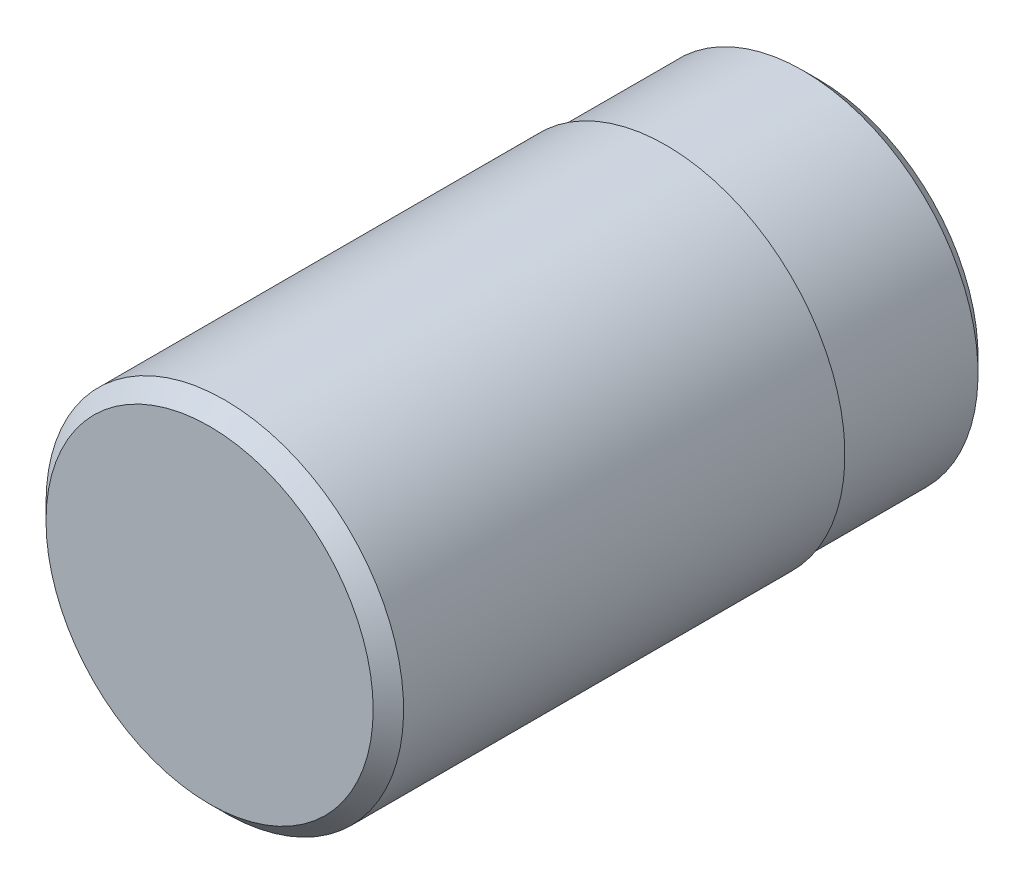
ISO-10303-21;
HEADER;
FILE_DESCRIPTION(('STEP AP214'),'2;1');
FILE_NAME('part.step','',(''),(''),'','','');
FILE_SCHEMA(('AUTOMOTIVE_DESIGN { 1 0 10303 214 1 1 1 1 }'));
ENDSEC;
DATA;
#1=APPLICATION_CONTEXT('core data for automotive mechanical design processes');
#2=APPLICATION_PROTOCOL_DEFINITION('international standard','automotive_design',2000,#1);
#3=PRODUCT_CONTEXT('',#1,'mechanical');
#4=PRODUCT('Part','Part','',(#3));
#5=PRODUCT_RELATED_PRODUCT_CATEGORY('part','',(#4));
#6=PRODUCT_DEFINITION_FORMATION('','',#4);
#7=PRODUCT_DEFINITION_CONTEXT('part definition',#1,'design');
#8=PRODUCT_DEFINITION('design','',#6,#7);
#9=PRODUCT_DEFINITION_SHAPE('','',#8);
#10=(LENGTH_UNIT() NAMED_UNIT(*) SI_UNIT(.MILLI.,.METRE.));
#11=(NAMED_UNIT(*) PLANE_ANGLE_UNIT() SI_UNIT($,.RADIAN.));
#12=(NAMED_UNIT(*) SI_UNIT($,.STERADIAN.) SOLID_ANGLE_UNIT());
#13=UNCERTAINTY_MEASURE_WITH_UNIT(LENGTH_MEASURE(1.E-05),#10,'distance_accuracy_value','');
#14=(GEOMETRIC_REPRESENTATION_CONTEXT(3) GLOBAL_UNCERTAINTY_ASSIGNED_CONTEXT((#13)) GLOBAL_UNIT_ASSIGNED_CONTEXT((#10,
#11,#12)) REPRESENTATION_CONTEXT('',''));
#15=CARTESIAN_POINT('',(0.,0.,0.));
#16=DIRECTION('',(0.,0.,1.));
#17=DIRECTION('',(1.,0.,0.));
#18=AXIS2_PLACEMENT_3D('',#15,#16,#17);
#19=CARTESIAN_POINT('',(0.,0.,3.5));
#20=DIRECTION('',(0.,0.,1.));
#21=DIRECTION('',(1.,0.,0.));
#22=AXIS2_PLACEMENT_3D('',#19,#20,#21);
#23=PLANE('',#22);
#24=CARTESIAN_POINT('',(0.,-27.8,3.5));
#25=DIRECTION('',(0.,0.,1.));
#26=DIRECTION('',(-1.,0.,0.));
#27=AXIS2_PLACEMENT_3D('',#24,#25,#26);
#28=CIRCLE('',#27,2.15);
#29=CARTESIAN_POINT('',(0.,-25.65,3.5));
#30=VERTEX_POINT('',#29);
#31=EDGE_CURVE('E125',#30,#30,#28,.T.);
#32=ORIENTED_EDGE('',*,*,#31,.T.);
#33=EDGE_LOOP('',(#32));
#34=FACE_BOUND('',#33,.T.);
#35=ADVANCED_FACE('F16',(#34),#23,.T.);
#36=CARTESIAN_POINT('',(0.,-27.8,-2.5));
#37=DIRECTION('',(0.,0.,1.));
#38=DIRECTION('',(1.,0.,0.));
#39=AXIS2_PLACEMENT_3D('',#36,#37,#38);
#40=CYLINDRICAL_SURFACE('',#39,2.35);
#41=CARTESIAN_POINT('',(0.,-27.8,3.3));
#42=DIRECTION('',(0.,0.,1.));
#43=DIRECTION('',(-1.,0.,0.));
#44=AXIS2_PLACEMENT_3D('',#41,#42,#43);
#45=CIRCLE('',#44,2.35);
#46=CARTESIAN_POINT('',(-2.35,-27.8,3.3));
#47=VERTEX_POINT('',#46);
#48=CARTESIAN_POINT('',(0.,-25.45,3.3));
#49=VERTEX_POINT('',#48);
#50=EDGE_CURVE('E126',#47,#49,#45,.T.);
#51=ORIENTED_EDGE('',*,*,#50,.F.);
#52=DIRECTION('',(0.,0.,-1.));
#53=VECTOR('',#52,1.);
#54=CARTESIAN_POINT('',(-2.35,-27.8,-2.5));
#55=LINE('',#54,#53);
#56=CARTESIAN_POINT('',(-2.35,-27.8,-2.5));
#57=VERTEX_POINT('',#56);
#58=EDGE_CURVE('E11',#47,#57,#55,.T.);
#59=ORIENTED_EDGE('',*,*,#58,.T.);
#60=CARTESIAN_POINT('',(0.,-27.8,-2.5));
#61=DIRECTION('',(0.,0.,-1.));
#62=DIRECTION('',(1.,0.,0.));
#63=AXIS2_PLACEMENT_3D('',#60,#61,#62);
#64=CIRCLE('',#63,2.35);
#65=EDGE_CURVE('E26',#57,#57,#64,.T.);
#66=ORIENTED_EDGE('',*,*,#65,.F.);
#67=ORIENTED_EDGE('',*,*,#58,.F.);
#68=CARTESIAN_POINT('',(0.,-27.8,3.3));
#69=DIRECTION('',(0.,0.,1.));
#70=DIRECTION('',(-1.,0.,0.));
#71=AXIS2_PLACEMENT_3D('',#68,#69,#70);
#72=CIRCLE('',#71,2.35);
#73=EDGE_CURVE('E120',#49,#47,#72,.T.);
#74=ORIENTED_EDGE('',*,*,#73,.F.);
#75=EDGE_LOOP('',(#51,#59,#66,#67,#74));
#76=FACE_BOUND('',#75,.T.);
#77=ADVANCED_FACE('F191',(#76),#40,.T.);
#78=CARTESIAN_POINT('',(0.,0.,-2.5));
#79=DIRECTION('',(0.,0.,1.));
#80=DIRECTION('',(1.,0.,0.));
#81=AXIS2_PLACEMENT_3D('',#78,#79,#80);
#82=PLANE('',#81);
#83=CARTESIAN_POINT('',(0.,-27.8,-2.5));
#84=DIRECTION('',(0.,0.,1.));
#85=DIRECTION('',(1.,0.,0.));
#86=AXIS2_PLACEMENT_3D('',#83,#84,#85);
#87=CIRCLE('',#86,2.3);
#88=CARTESIAN_POINT('',(-2.3,-27.8,-2.5));
#89=VERTEX_POINT('',#88);
#90=EDGE_CURVE('E151',#89,#89,#87,.T.);
#91=ORIENTED_EDGE('',*,*,#90,.T.);
#92=EDGE_LOOP('',(#91));
#93=FACE_BOUND('',#92,.T.);
#94=ORIENTED_EDGE('',*,*,#65,.T.);
#95=EDGE_LOOP('',(#94));
#96=FACE_BOUND('',#95,.T.);
#97=ADVANCED_FACE('F193',(#93,#96),#82,.F.);
#98=CARTESIAN_POINT('',(0.,-27.8,-2.5));
#99=DIRECTION('',(0.,0.,1.));
#100=DIRECTION('',(1.,0.,0.));
#101=AXIS2_PLACEMENT_3D('',#98,#99,#100);
#102=CYLINDRICAL_SURFACE('',#101,2.3);
#103=ORIENTED_EDGE('',*,*,#90,.F.);
#104=DIRECTION('',(0.,0.,-1.));
#105=VECTOR('',#104,1.);
#106=CARTESIAN_POINT('',(-2.3,-27.8,-2.5));
#107=LINE('',#106,#105);
#108=CARTESIAN_POINT('',(-2.3,-27.8,-4.3));
#109=VERTEX_POINT('',#108);
#110=EDGE_CURVE('E19',#89,#109,#107,.T.);
#111=ORIENTED_EDGE('',*,*,#110,.T.);
#112=CARTESIAN_POINT('',(0.,-27.8,-4.3));
#113=DIRECTION('',(0.,0.,-1.));
#114=DIRECTION('',(1.,0.,0.));
#115=AXIS2_PLACEMENT_3D('',#112,#113,#114);
#116=CIRCLE('',#115,2.3);
#117=CARTESIAN_POINT('',(0.,-25.5,-4.3));
#118=VERTEX_POINT('',#117);
#119=EDGE_CURVE('E115',#118,#109,#116,.T.);
#120=ORIENTED_EDGE('',*,*,#119,.F.);
#121=CARTESIAN_POINT('',(0.,-27.8,-4.3));
#122=DIRECTION('',(0.,0.,-1.));
#123=DIRECTION('',(1.,0.,0.));
#124=AXIS2_PLACEMENT_3D('',#121,#122,#123);
#125=CIRCLE('',#124,2.3);
#126=EDGE_CURVE('E119',#109,#118,#125,.T.);
#127=ORIENTED_EDGE('',*,*,#126,.F.);
#128=ORIENTED_EDGE('',*,*,#110,.F.);
#129=EDGE_LOOP('',(#103,#111,#120,#127,#128));
#130=FACE_BOUND('',#129,.T.);
#131=ADVANCED_FACE('F178',(#130),#102,.T.);
#132=CARTESIAN_POINT('',(0.,-27.8,2.597363530241));
#133=DIRECTION('',(0.,0.,-1.));
#134=DIRECTION('',(0.,-1.,0.));
#135=AXIS2_PLACEMENT_3D('',#132,#133,#134);
#136=CONICAL_SURFACE('',#135,0.697386822603199,1.0471975511964);
#137=DIRECTION('',(0.,0.86602540378434,-0.500000000000171));
#138=VECTOR('',#137,1.);
#139=CARTESIAN_POINT('',(0.,-27.1026131773968,2.597363530241));
#140=LINE('',#139,#138);
#141=CARTESIAN_POINT('',(0.,-27.8,3.));
#142=VERTEX_POINT('',#141);
#143=CARTESIAN_POINT('',(0.,-26.7,2.36491470389142));
#144=VERTEX_POINT('',#143);
#145=EDGE_CURVE('E113',#142,#144,#140,.T.);
#146=ORIENTED_EDGE('',*,*,#145,.T.);
#147=CARTESIAN_POINT('',(0.,-27.8,2.364914703891));
#148=DIRECTION('',(0.,0.,1.));
#149=DIRECTION('',(1.,0.,0.));
#150=AXIS2_PLACEMENT_3D('',#147,#148,#149);
#151=CIRCLE('',#150,1.1);
#152=CARTESIAN_POINT('',(-1.1,-27.8,2.364914703891));
#153=VERTEX_POINT('',#152);
#154=EDGE_CURVE('E136',#153,#144,#151,.T.);
#155=ORIENTED_EDGE('',*,*,#154,.F.);
#156=CARTESIAN_POINT('',(0.,-27.8,2.364914703891));
#157=DIRECTION('',(0.,0.,1.));
#158=DIRECTION('',(1.,0.,0.));
#159=AXIS2_PLACEMENT_3D('',#156,#157,#158);
#160=CIRCLE('',#159,1.1);
#161=EDGE_CURVE('E155',#144,#153,#160,.T.);
#162=ORIENTED_EDGE('',*,*,#161,.F.);
#163=ORIENTED_EDGE('',*,*,#145,.F.);
#164=EDGE_LOOP('',(#146,#155,#162,#163));
#165=FACE_BOUND('',#164,.T.);
#166=ADVANCED_FACE('F212',(#165),#136,.F.);
#167=CARTESIAN_POINT('',(0.,-27.8,-2.5));
#168=DIRECTION('',(0.,0.,1.));
#169=DIRECTION('',(1.,0.,0.));
#170=AXIS2_PLACEMENT_3D('',#167,#168,#169);
#171=CYLINDRICAL_SURFACE('',#170,1.1);
#172=CARTESIAN_POINT('',(0.,-27.8,-4.3));
#173=DIRECTION('',(0.,0.,1.));
#174=DIRECTION('',(-1.,0.,0.));
#175=AXIS2_PLACEMENT_3D('',#172,#173,#174);
#176=CIRCLE('',#175,1.1);
#177=CARTESIAN_POINT('',(-1.1,-27.8,-4.3));
#178=VERTEX_POINT('',#177);
#179=CARTESIAN_POINT('',(0.,-26.7,-4.3));
#180=VERTEX_POINT('',#179);
#181=EDGE_CURVE('E109',#178,#180,#176,.T.);
#182=ORIENTED_EDGE('',*,*,#181,.F.);
#183=DIRECTION('',(0.,0.,1.));
#184=VECTOR('',#183,1.);
#185=CARTESIAN_POINT('',(-1.1,-27.8,-2.5));
#186=LINE('',#185,#184);
#187=EDGE_CURVE('E84',#178,#153,#186,.T.);
#188=ORIENTED_EDGE('',*,*,#187,.T.);
#189=ORIENTED_EDGE('',*,*,#154,.T.);
#190=ORIENTED_EDGE('',*,*,#161,.T.);
#191=ORIENTED_EDGE('',*,*,#187,.F.);
#192=CARTESIAN_POINT('',(0.,-27.8,-4.3));
#193=DIRECTION('',(0.,0.,1.));
#194=DIRECTION('',(-1.,0.,0.));
#195=AXIS2_PLACEMENT_3D('',#192,#193,#194);
#196=CIRCLE('',#195,1.1);
#197=EDGE_CURVE('E100',#180,#178,#196,.T.);
#198=ORIENTED_EDGE('',*,*,#197,.F.);
#199=EDGE_LOOP('',(#182,#188,#189,#190,#191,#198));
#200=FACE_BOUND('',#199,.T.);
#201=ADVANCED_FACE('F203',(#200),#171,.F.);
#202=CARTESIAN_POINT('',(0.,0.,-4.5));
#203=DIRECTION('',(0.,0.,1.));
#204=DIRECTION('',(1.,0.,0.));
#205=AXIS2_PLACEMENT_3D('',#202,#203,#204);
#206=PLANE('',#205);
#207=CARTESIAN_POINT('',(0.,-27.8,-4.5));
#208=DIRECTION('',(0.,0.,1.));
#209=DIRECTION('',(-1.,0.,0.));
#210=AXIS2_PLACEMENT_3D('',#207,#208,#209);
#211=CIRCLE('',#210,1.3);
#212=CARTESIAN_POINT('',(0.,-26.5,-4.5));
#213=VERTEX_POINT('',#212);
#214=EDGE_CURVE('E94',#213,#213,#211,.T.);
#215=ORIENTED_EDGE('',*,*,#214,.T.);
#216=EDGE_LOOP('',(#215));
#217=FACE_BOUND('',#216,.T.);
#218=CARTESIAN_POINT('',(0.,-27.8,-4.5));
#219=DIRECTION('',(0.,0.,-1.));
#220=DIRECTION('',(1.,0.,0.));
#221=AXIS2_PLACEMENT_3D('',#218,#219,#220);
#222=CIRCLE('',#221,2.1);
#223=CARTESIAN_POINT('',(0.,-25.7,-4.5));
#224=VERTEX_POINT('',#223);
#225=EDGE_CURVE('E74',#224,#224,#222,.T.);
#226=ORIENTED_EDGE('',*,*,#225,.T.);
#227=EDGE_LOOP('',(#226));
#228=FACE_BOUND('',#227,.T.);
#229=ADVANCED_FACE('F95',(#217,#228),#206,.F.);
#230=CARTESIAN_POINT('',(0.,-27.8,-4.399999959226));
#231=DIRECTION('',(0.,0.,-1.));
#232=DIRECTION('',(0.,-1.,0.));
#233=AXIS2_PLACEMENT_3D('',#230,#231,#232);
#234=CONICAL_SURFACE('',#233,1.199999959226,0.7853981633973);
#235=ORIENTED_EDGE('',*,*,#181,.T.);
#236=DIRECTION('',(0.,0.707106781186442,-0.707106781186653));
#237=VECTOR('',#236,1.);
#238=CARTESIAN_POINT('',(0.,-26.600000040774,-4.399999959226));
#239=LINE('',#238,#237);
#240=EDGE_CURVE('E101',#180,#213,#239,.T.);
#241=ORIENTED_EDGE('',*,*,#240,.T.);
#242=ORIENTED_EDGE('',*,*,#214,.F.);
#243=ORIENTED_EDGE('',*,*,#240,.F.);
#244=ORIENTED_EDGE('',*,*,#197,.T.);
#245=EDGE_LOOP('',(#235,#241,#242,#243,#244));
#246=FACE_BOUND('',#245,.T.);
#247=ADVANCED_FACE('F205',(#246),#234,.F.);
#248=CARTESIAN_POINT('',(0.,-27.8,-4.400000000788));
#249=DIRECTION('',(0.,0.,1.));
#250=DIRECTION('',(0.,-1.,0.));
#251=AXIS2_PLACEMENT_3D('',#248,#249,#250);
#252=CONICAL_SURFACE('',#251,2.199999999212,0.7853981633973);
#253=ORIENTED_EDGE('',*,*,#119,.T.);
#254=ORIENTED_EDGE('',*,*,#126,.T.);
#255=DIRECTION('',(0.,-0.707106781186442,-0.707106781186653));
#256=VECTOR('',#255,1.);
#257=CARTESIAN_POINT('',(0.,-25.600000000788,-4.400000000788));
#258=LINE('',#257,#256);
#259=EDGE_CURVE('E130',#118,#224,#258,.T.);
#260=ORIENTED_EDGE('',*,*,#259,.T.);
#261=ORIENTED_EDGE('',*,*,#225,.F.);
#262=ORIENTED_EDGE('',*,*,#259,.F.);
#263=EDGE_LOOP('',(#253,#254,#260,#261,#262));
#264=FACE_BOUND('',#263,.T.);
#265=ADVANCED_FACE('F181',(#264),#252,.T.);
#266=CARTESIAN_POINT('',(0.,-27.8,3.400000000867));
#267=DIRECTION('',(0.,0.,-1.));
#268=DIRECTION('',(0.,-1.,0.));
#269=AXIS2_PLACEMENT_3D('',#266,#267,#268);
#270=CONICAL_SURFACE('',#269,2.249999999133,0.7853981633973);
#271=ORIENTED_EDGE('',*,*,#50,.T.);
#272=DIRECTION('',(0.,-0.707106781186442,0.707106781186653));
#273=VECTOR('',#272,1.);
#274=CARTESIAN_POINT('',(0.,-25.550000000867,3.400000000867));
#275=LINE('',#274,#273);
#276=EDGE_CURVE('E121',#49,#30,#275,.T.);
#277=ORIENTED_EDGE('',*,*,#276,.T.);
#278=ORIENTED_EDGE('',*,*,#31,.F.);
#279=ORIENTED_EDGE('',*,*,#276,.F.);
#280=ORIENTED_EDGE('',*,*,#73,.T.);
#281=EDGE_LOOP('',(#271,#277,#278,#279,#280));
#282=FACE_BOUND('',#281,.T.);
#283=ADVANCED_FACE('F190',(#282),#270,.T.);
#284=CLOSED_SHELL('',(#35,#77,#97,#131,#166,#201,#229,#247,#265,#283));
#285=MANIFOLD_SOLID_BREP('B1',#284);
#286=ADVANCED_BREP_SHAPE_REPRESENTATION('',(#18,#285),#14);
#287=SHAPE_DEFINITION_REPRESENTATION(#9,#286);
ENDSEC;
END-ISO-10303-21;
